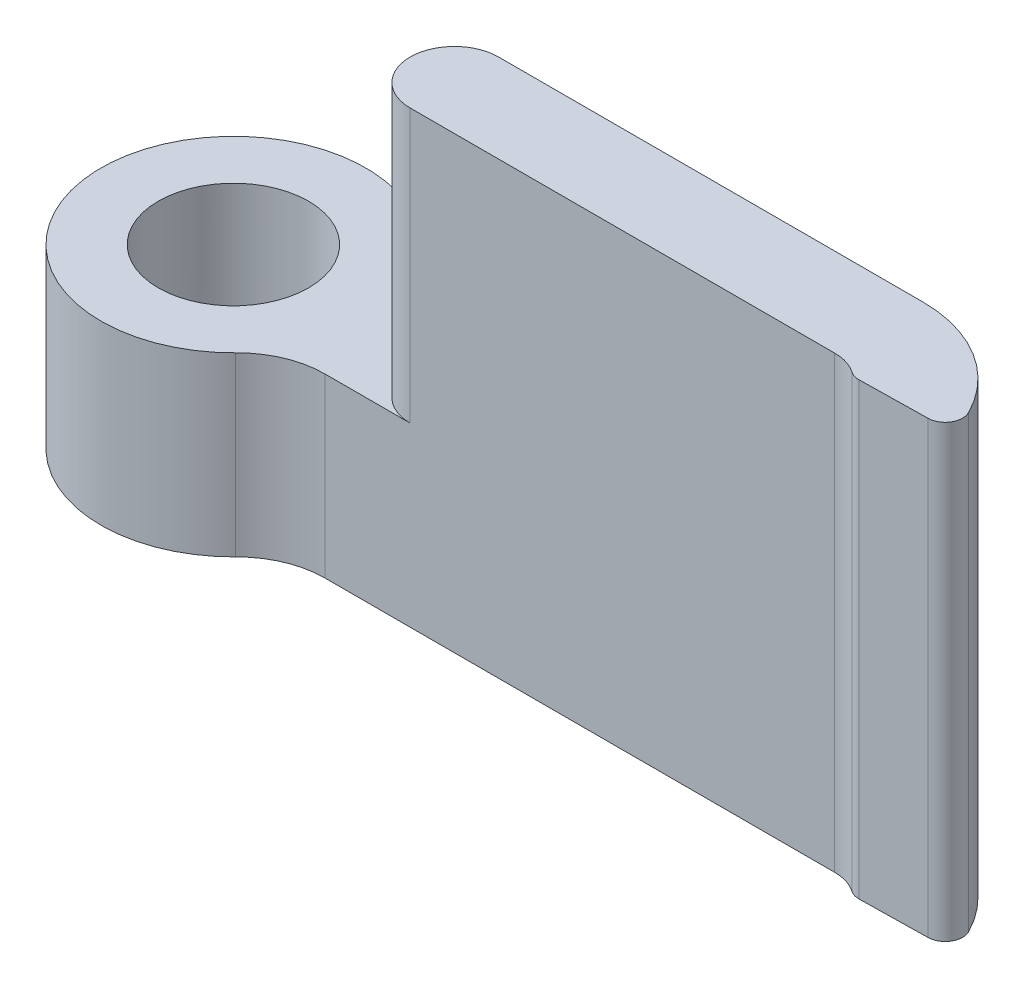
ISO-10303-21;
HEADER;
FILE_DESCRIPTION(('STEP AP214'),'2;1');
FILE_NAME('part.step','',(''),(''),'','','');
FILE_SCHEMA(('AUTOMOTIVE_DESIGN { 1 0 10303 214 1 1 1 1 }'));
ENDSEC;
DATA;
#1=APPLICATION_CONTEXT('core data for automotive mechanical design processes');
#2=APPLICATION_PROTOCOL_DEFINITION('international standard','automotive_design',2000,#1);
#3=PRODUCT_CONTEXT('',#1,'mechanical');
#4=PRODUCT('Part','Part','',(#3));
#5=PRODUCT_RELATED_PRODUCT_CATEGORY('part','',(#4));
#6=PRODUCT_DEFINITION_FORMATION('','',#4);
#7=PRODUCT_DEFINITION_CONTEXT('part definition',#1,'design');
#8=PRODUCT_DEFINITION('design','',#6,#7);
#9=PRODUCT_DEFINITION_SHAPE('','',#8);
#10=(LENGTH_UNIT() NAMED_UNIT(*) SI_UNIT(.MILLI.,.METRE.));
#11=(NAMED_UNIT(*) PLANE_ANGLE_UNIT() SI_UNIT($,.RADIAN.));
#12=(NAMED_UNIT(*) SI_UNIT($,.STERADIAN.) SOLID_ANGLE_UNIT());
#13=UNCERTAINTY_MEASURE_WITH_UNIT(LENGTH_MEASURE(1.E-05),#10,'distance_accuracy_value','');
#14=(GEOMETRIC_REPRESENTATION_CONTEXT(3) GLOBAL_UNCERTAINTY_ASSIGNED_CONTEXT((#13)) GLOBAL_UNIT_ASSIGNED_CONTEXT((#10,
#11,#12)) REPRESENTATION_CONTEXT('',''));
#15=CARTESIAN_POINT('',(0.,0.,0.));
#16=DIRECTION('',(0.,0.,1.));
#17=DIRECTION('',(1.,0.,0.));
#18=AXIS2_PLACEMENT_3D('',#15,#16,#17);
#19=CARTESIAN_POINT('',(19.1841197027665,20.63,3.175));
#20=DIRECTION('',(0.,-1.,0.));
#21=DIRECTION('',(0.,0.,-1.));
#22=AXIS2_PLACEMENT_3D('',#19,#20,#21);
#23=CYLINDRICAL_SURFACE('',#22,3.81);
#24=CARTESIAN_POINT('',(19.1841197027665,3.856199918,3.175));
#25=DIRECTION('',(0.,-1.,0.));
#26=DIRECTION('',(0.,0.,-1.));
#27=AXIS2_PLACEMENT_3D('',#24,#25,#26);
#28=CIRCLE('',#27,3.81);
#29=CARTESIAN_POINT('',(19.1841197027665,3.856199918,-0.635));
#30=VERTEX_POINT('',#29);
#31=CARTESIAN_POINT('',(22.5865531446849,3.856199918,1.46048937789378));
#32=VERTEX_POINT('',#31);
#33=EDGE_CURVE('E245',#30,#32,#28,.T.);
#34=ORIENTED_EDGE('',*,*,#33,.F.);
#35=DIRECTION('',(0.,-1.,0.));
#36=VECTOR('',#35,1.);
#37=CARTESIAN_POINT('',(19.1841197027665,20.63,-0.635));
#38=LINE('',#37,#36);
#39=CARTESIAN_POINT('',(19.1841197027665,16.7786,-0.635));
#40=VERTEX_POINT('',#39);
#41=EDGE_CURVE('E165',#40,#30,#38,.T.);
#42=ORIENTED_EDGE('',*,*,#41,.F.);
#43=CARTESIAN_POINT('',(19.1841197027665,16.7786,3.175));
#44=DIRECTION('',(0.,1.,0.));
#45=DIRECTION('',(0.,0.,1.));
#46=AXIS2_PLACEMENT_3D('',#43,#44,#45);
#47=CIRCLE('',#46,3.81);
#48=CARTESIAN_POINT('',(22.5865531446849,16.7786,1.46048937789378));
#49=VERTEX_POINT('',#48);
#50=EDGE_CURVE('E172',#49,#40,#47,.T.);
#51=ORIENTED_EDGE('',*,*,#50,.F.);
#52=DIRECTION('',(0.,-1.,0.));
#53=VECTOR('',#52,1.);
#54=CARTESIAN_POINT('',(22.5865531446849,20.63,1.46048937789378));
#55=LINE('',#54,#53);
#56=EDGE_CURVE('E168',#49,#32,#55,.T.);
#57=ORIENTED_EDGE('',*,*,#56,.T.);
#58=EDGE_LOOP('',(#34,#42,#51,#57));
#59=FACE_BOUND('',#58,.T.);
#60=ADVANCED_FACE('F35',(#59),#23,.T.);
#61=CARTESIAN_POINT('',(5.49926131403118,20.63,-0.635));
#62=DIRECTION('',(0.,0.,1.));
#63=DIRECTION('',(1.,0.,0.));
#64=AXIS2_PLACEMENT_3D('',#61,#62,#63);
#65=PLANE('',#64);
#66=DIRECTION('',(-1.,0.,0.));
#67=VECTOR('',#66,1.);
#68=CARTESIAN_POINT('',(5.49926131403118,8.936199918,-0.635));
#69=LINE('',#68,#67);
#70=CARTESIAN_POINT('',(6.985,8.936199918,-0.635));
#71=VERTEX_POINT('',#70);
#72=CARTESIAN_POINT('',(5.49926131403118,8.936199918,-0.635000000000001));
#73=VERTEX_POINT('',#72);
#74=EDGE_CURVE('E199',#71,#73,#69,.T.);
#75=ORIENTED_EDGE('',*,*,#74,.F.);
#76=DIRECTION('',(0.,1.,0.));
#77=VECTOR('',#76,1.);
#78=CARTESIAN_POINT('',(6.985,20.63,-0.635));
#79=LINE('',#78,#77);
#80=CARTESIAN_POINT('',(6.985,16.7786,-0.635));
#81=VERTEX_POINT('',#80);
#82=EDGE_CURVE('E185',#71,#81,#79,.T.);
#83=ORIENTED_EDGE('',*,*,#82,.T.);
#84=DIRECTION('',(-1.,0.,0.));
#85=VECTOR('',#84,1.);
#86=CARTESIAN_POINT('',(5.49926131403118,16.7786,-0.635));
#87=LINE('',#86,#85);
#88=EDGE_CURVE('E208',#40,#81,#87,.T.);
#89=ORIENTED_EDGE('',*,*,#88,.F.);
#90=ORIENTED_EDGE('',*,*,#41,.T.);
#91=DIRECTION('',(1.,0.,0.));
#92=VECTOR('',#91,1.);
#93=CARTESIAN_POINT('',(5.49926131403118,3.856199918,-0.635));
#94=LINE('',#93,#92);
#95=CARTESIAN_POINT('',(5.49926131403118,3.856199918,-0.635000000000001));
#96=VERTEX_POINT('',#95);
#97=EDGE_CURVE('E243',#96,#30,#94,.T.);
#98=ORIENTED_EDGE('',*,*,#97,.F.);
#99=DIRECTION('',(0.,-1.,0.));
#100=VECTOR('',#99,1.);
#101=CARTESIAN_POINT('',(5.49926131403118,20.63,-0.635));
#102=LINE('',#101,#100);
#103=EDGE_CURVE('E157',#73,#96,#102,.T.);
#104=ORIENTED_EDGE('',*,*,#103,.F.);
#105=EDGE_LOOP('',(#75,#83,#89,#90,#98,#104));
#106=FACE_BOUND('',#105,.T.);
#107=ADVANCED_FACE('F207',(#106),#65,.F.);
#108=CARTESIAN_POINT('',(19.1841197027665,20.63,1.905));
#109=DIRECTION('',(0.,0.,-1.));
#110=DIRECTION('',(-1.,0.,0.));
#111=AXIS2_PLACEMENT_3D('',#108,#109,#110);
#112=PLANE('',#111);
#113=DIRECTION('',(1.,0.,0.));
#114=VECTOR('',#113,1.);
#115=CARTESIAN_POINT('',(19.1841197027665,16.7786,1.905));
#116=LINE('',#115,#114);
#117=CARTESIAN_POINT('',(6.985,16.7786,1.905));
#118=VERTEX_POINT('',#117);
#119=CARTESIAN_POINT('',(19.1841197027665,16.7786,1.905));
#120=VERTEX_POINT('',#119);
#121=EDGE_CURVE('E219',#118,#120,#116,.T.);
#122=ORIENTED_EDGE('',*,*,#121,.F.);
#123=DIRECTION('',(0.,-1.,0.));
#124=VECTOR('',#123,1.);
#125=CARTESIAN_POINT('',(6.985,20.63,1.905));
#126=LINE('',#125,#124);
#127=CARTESIAN_POINT('',(6.985,8.936199918,1.905));
#128=VERTEX_POINT('',#127);
#129=EDGE_CURVE('E194',#118,#128,#126,.T.);
#130=ORIENTED_EDGE('',*,*,#129,.T.);
#131=DIRECTION('',(1.,0.,0.));
#132=VECTOR('',#131,1.);
#133=CARTESIAN_POINT('',(19.1841197027665,8.936199918,1.905));
#134=LINE('',#133,#132);
#135=CARTESIAN_POINT('',(4.53480705212471,8.936199918,1.905));
#136=VERTEX_POINT('',#135);
#137=EDGE_CURVE('E54',#136,#128,#134,.T.);
#138=ORIENTED_EDGE('',*,*,#137,.F.);
#139=DIRECTION('',(0.,-1.,0.));
#140=VECTOR('',#139,1.);
#141=CARTESIAN_POINT('',(4.53480705212471,20.63,1.905));
#142=LINE('',#141,#140);
#143=CARTESIAN_POINT('',(4.53480705212471,3.856199918,1.905));
#144=VERTEX_POINT('',#143);
#145=EDGE_CURVE('E155',#136,#144,#142,.T.);
#146=ORIENTED_EDGE('',*,*,#145,.T.);
#147=DIRECTION('',(-1.,0.,0.));
#148=VECTOR('',#147,1.);
#149=CARTESIAN_POINT('',(19.1841197027665,3.856199918,1.905));
#150=LINE('',#149,#148);
#151=CARTESIAN_POINT('',(19.1841197027665,3.856199918,1.905));
#152=VERTEX_POINT('',#151);
#153=EDGE_CURVE('E135',#152,#144,#150,.T.);
#154=ORIENTED_EDGE('',*,*,#153,.F.);
#155=DIRECTION('',(0.,-1.,0.));
#156=VECTOR('',#155,1.);
#157=CARTESIAN_POINT('',(19.1841197027665,20.63,1.905));
#158=LINE('',#157,#156);
#159=EDGE_CURVE('E159',#120,#152,#158,.T.);
#160=ORIENTED_EDGE('',*,*,#159,.F.);
#161=EDGE_LOOP('',(#122,#130,#138,#146,#154,#160));
#162=FACE_BOUND('',#161,.T.);
#163=ADVANCED_FACE('F241',(#162),#112,.F.);
#164=CARTESIAN_POINT('',(19.1841197027665,20.63,3.175));
#165=DIRECTION('',(0.,-1.,0.));
#166=DIRECTION('',(0.,0.,-1.));
#167=AXIS2_PLACEMENT_3D('',#164,#165,#166);
#168=CYLINDRICAL_SURFACE('',#167,1.27);
#169=CARTESIAN_POINT('',(19.1841197027665,3.856199918,3.175));
#170=DIRECTION('',(0.,-1.,0.));
#171=DIRECTION('',(0.,0.,-1.));
#172=AXIS2_PLACEMENT_3D('',#169,#170,#171);
#173=CIRCLE('',#172,1.27);
#174=CARTESIAN_POINT('',(19.9067946493673,3.856199918,2.13066244846051));
#175=VERTEX_POINT('',#174);
#176=EDGE_CURVE('E235',#175,#152,#173,.F.);
#177=ORIENTED_EDGE('',*,*,#176,.F.);
#178=DIRECTION('',(0.,-1.,0.));
#179=VECTOR('',#178,1.);
#180=CARTESIAN_POINT('',(19.9067946493673,20.63,2.13066244846051));
#181=LINE('',#180,#179);
#182=CARTESIAN_POINT('',(19.9067946493673,16.7786,2.13066244846051));
#183=VERTEX_POINT('',#182);
#184=EDGE_CURVE('E180',#175,#183,#181,.F.);
#185=ORIENTED_EDGE('',*,*,#184,.T.);
#186=CARTESIAN_POINT('',(19.1841197027665,16.7786,3.175));
#187=DIRECTION('',(0.,1.,0.));
#188=DIRECTION('',(0.,0.,1.));
#189=AXIS2_PLACEMENT_3D('',#186,#187,#188);
#190=CIRCLE('',#189,1.27);
#191=EDGE_CURVE('E238',#120,#183,#190,.F.);
#192=ORIENTED_EDGE('',*,*,#191,.F.);
#193=ORIENTED_EDGE('',*,*,#159,.T.);
#194=EDGE_LOOP('',(#177,#185,#192,#193));
#195=FACE_BOUND('',#194,.T.);
#196=ADVANCED_FACE('F234',(#195),#168,.F.);
#197=CARTESIAN_POINT('',(22.86,20.63,2.17299997983507));
#198=DIRECTION('',(-0.0174524064372835,0.,-0.999847695156391));
#199=DIRECTION('',(-0.999847695156391,0.,0.0174524064372835));
#200=AXIS2_PLACEMENT_3D('',#197,#198,#199);
#201=PLANE('',#200);
#202=DIRECTION('',(-0.999847695156391,0.,0.0174524064372835));
#203=VECTOR('',#202,1.);
#204=CARTESIAN_POINT('',(22.86,3.856199918,2.17299997983507));
#205=LINE('',#204,#203);
#206=CARTESIAN_POINT('',(22.1487657728487,3.856199918,2.18541461944917));
#207=VERTEX_POINT('',#206);
#208=CARTESIAN_POINT('',(20.2000385480981,3.856199918,2.21942977968457));
#209=VERTEX_POINT('',#208);
#210=EDGE_CURVE('E253',#207,#209,#205,.T.);
#211=ORIENTED_EDGE('',*,*,#210,.F.);
#212=DIRECTION('',(0.,-1.,0.));
#213=VECTOR('',#212,1.);
#214=CARTESIAN_POINT('',(22.1487657728487,20.63,2.18541461944917));
#215=LINE('',#214,#213);
#216=CARTESIAN_POINT('',(22.1487657728487,16.7786,2.18541461944917));
#217=VERTEX_POINT('',#216);
#218=EDGE_CURVE('E178',#207,#217,#215,.F.);
#219=ORIENTED_EDGE('',*,*,#218,.T.);
#220=DIRECTION('',(0.999847695156391,0.,-0.0174524064372835));
#221=VECTOR('',#220,1.);
#222=CARTESIAN_POINT('',(22.86,16.7786,2.17299997983507));
#223=LINE('',#222,#221);
#224=CARTESIAN_POINT('',(20.2000385480981,16.7786,2.21942977968457));
#225=VERTEX_POINT('',#224);
#226=EDGE_CURVE('E259',#225,#217,#223,.T.);
#227=ORIENTED_EDGE('',*,*,#226,.F.);
#228=DIRECTION('',(0.,-1.,0.));
#229=VECTOR('',#228,1.);
#230=CARTESIAN_POINT('',(20.2000385480981,20.63,2.21942977968457));
#231=LINE('',#230,#229);
#232=EDGE_CURVE('E175',#225,#209,#231,.T.);
#233=ORIENTED_EDGE('',*,*,#232,.T.);
#234=EDGE_LOOP('',(#211,#219,#227,#233));
#235=FACE_BOUND('',#234,.T.);
#236=ADVANCED_FACE('F283',(#235),#201,.F.);
#237=CARTESIAN_POINT('',(22.14003956963,20.63,1.68549077187097));
#238=DIRECTION('',(0.,-1.,0.));
#239=DIRECTION('',(0.,0.,-1.));
#240=AXIS2_PLACEMENT_3D('',#237,#238,#239);
#241=CYLINDRICAL_SURFACE('',#240,0.5);
#242=ORIENTED_EDGE('',*,*,#218,.F.);
#243=CARTESIAN_POINT('',(22.14003956963,3.856199918,1.68549077187097));
#244=DIRECTION('',(0.,-1.,0.));
#245=DIRECTION('',(0.,0.,-1.));
#246=AXIS2_PLACEMENT_3D('',#243,#244,#245);
#247=CIRCLE('',#246,0.5);
#248=EDGE_CURVE('E250',#207,#32,#247,.F.);
#249=ORIENTED_EDGE('',*,*,#248,.T.);
#250=ORIENTED_EDGE('',*,*,#56,.F.);
#251=CARTESIAN_POINT('',(22.14003956963,16.7786,1.68549077187097));
#252=DIRECTION('',(0.,1.,0.));
#253=DIRECTION('',(0.,0.,1.));
#254=AXIS2_PLACEMENT_3D('',#251,#252,#253);
#255=CIRCLE('',#254,0.5);
#256=EDGE_CURVE('E215',#49,#217,#255,.F.);
#257=ORIENTED_EDGE('',*,*,#256,.T.);
#258=EDGE_LOOP('',(#242,#249,#250,#257));
#259=FACE_BOUND('',#258,.T.);
#260=ADVANCED_FACE('F279',(#259),#241,.T.);
#261=CARTESIAN_POINT('',(20.1913123448794,20.63,1.71950593210638));
#262=DIRECTION('',(0.,-1.,0.));
#263=DIRECTION('',(0.,0.,-1.));
#264=AXIS2_PLACEMENT_3D('',#261,#262,#263);
#265=CYLINDRICAL_SURFACE('',#264,0.5);
#266=ORIENTED_EDGE('',*,*,#184,.F.);
#267=CARTESIAN_POINT('',(20.1913123448794,3.856199918,1.71950593210638));
#268=DIRECTION('',(0.,-1.,0.));
#269=DIRECTION('',(0.,0.,-1.));
#270=AXIS2_PLACEMENT_3D('',#267,#268,#269);
#271=CIRCLE('',#270,0.5);
#272=EDGE_CURVE('E256',#175,#209,#271,.F.);
#273=ORIENTED_EDGE('',*,*,#272,.T.);
#274=ORIENTED_EDGE('',*,*,#232,.F.);
#275=CARTESIAN_POINT('',(20.1913123448794,16.7786,1.71950593210638));
#276=DIRECTION('',(0.,1.,0.));
#277=DIRECTION('',(0.,0.,1.));
#278=AXIS2_PLACEMENT_3D('',#275,#276,#277);
#279=CIRCLE('',#278,0.5);
#280=EDGE_CURVE('E182',#225,#183,#279,.F.);
#281=ORIENTED_EDGE('',*,*,#280,.T.);
#282=EDGE_LOOP('',(#266,#273,#274,#281));
#283=FACE_BOUND('',#282,.T.);
#284=ADVANCED_FACE('F282',(#283),#265,.T.);
#285=CARTESIAN_POINT('',(5.49926131403118,20.63,-3.175));
#286=DIRECTION('',(0.,-1.,0.));
#287=DIRECTION('',(0.,0.,-1.));
#288=AXIS2_PLACEMENT_3D('',#285,#286,#287);
#289=CYLINDRICAL_SURFACE('',#288,2.54);
#290=CARTESIAN_POINT('',(5.49926131403118,3.856199918,-3.175));
#291=DIRECTION('',(0.,-1.,0.));
#292=DIRECTION('',(0.,0.,-1.));
#293=AXIS2_PLACEMENT_3D('',#290,#291,#292);
#294=CIRCLE('',#293,2.54);
#295=CARTESIAN_POINT('',(3.29955678841871,3.856199918,-1.905));
#296=VERTEX_POINT('',#295);
#297=EDGE_CURVE('E150',#296,#96,#294,.F.);
#298=ORIENTED_EDGE('',*,*,#297,.F.);
#299=DIRECTION('',(0.,-1.,0.));
#300=VECTOR('',#299,1.);
#301=CARTESIAN_POINT('',(3.29955678841871,20.63,-1.905));
#302=LINE('',#301,#300);
#303=CARTESIAN_POINT('',(3.29955678841871,8.936199918,-1.905));
#304=VERTEX_POINT('',#303);
#305=EDGE_CURVE('E149',#304,#296,#302,.T.);
#306=ORIENTED_EDGE('',*,*,#305,.F.);
#307=CARTESIAN_POINT('',(5.49926131403118,8.936199918,-3.175));
#308=DIRECTION('',(0.,1.,0.));
#309=DIRECTION('',(0.,0.,1.));
#310=AXIS2_PLACEMENT_3D('',#307,#308,#309);
#311=CIRCLE('',#310,2.54);
#312=EDGE_CURVE('E227',#73,#304,#311,.F.);
#313=ORIENTED_EDGE('',*,*,#312,.F.);
#314=ORIENTED_EDGE('',*,*,#103,.T.);
#315=EDGE_LOOP('',(#298,#306,#313,#314));
#316=FACE_BOUND('',#315,.T.);
#317=ADVANCED_FACE('F286',(#316),#289,.F.);
#318=CARTESIAN_POINT('',(0.,20.63,0.));
#319=DIRECTION('',(0.,-1.,0.));
#320=DIRECTION('',(0.,0.,-1.));
#321=AXIS2_PLACEMENT_3D('',#318,#319,#320);
#322=CYLINDRICAL_SURFACE('',#321,3.80999999999999);
#323=CARTESIAN_POINT('',(0.,3.856199918,0.));
#324=DIRECTION('',(0.,-1.,0.));
#325=DIRECTION('',(0.,0.,-1.));
#326=AXIS2_PLACEMENT_3D('',#323,#324,#325);
#327=CIRCLE('',#326,3.80999999999999);
#328=CARTESIAN_POINT('',(2.72088423127483,3.856199918,2.667));
#329=VERTEX_POINT('',#328);
#330=EDGE_CURVE('E132',#329,#296,#327,.T.);
#331=ORIENTED_EDGE('',*,*,#330,.F.);
#332=DIRECTION('',(0.,-1.,0.));
#333=VECTOR('',#332,1.);
#334=CARTESIAN_POINT('',(2.72088423127483,20.63,2.667));
#335=LINE('',#334,#333);
#336=CARTESIAN_POINT('',(2.72088423127483,8.936199918,2.667));
#337=VERTEX_POINT('',#336);
#338=EDGE_CURVE('E147',#337,#329,#335,.T.);
#339=ORIENTED_EDGE('',*,*,#338,.F.);
#340=CARTESIAN_POINT('',(0.,8.936199918,0.));
#341=DIRECTION('',(0.,1.,0.));
#342=DIRECTION('',(0.,0.,1.));
#343=AXIS2_PLACEMENT_3D('',#340,#341,#342);
#344=CIRCLE('',#343,3.80999999999999);
#345=EDGE_CURVE('E225',#304,#337,#344,.T.);
#346=ORIENTED_EDGE('',*,*,#345,.F.);
#347=ORIENTED_EDGE('',*,*,#305,.T.);
#348=EDGE_LOOP('',(#331,#339,#346,#347));
#349=FACE_BOUND('',#348,.T.);
#350=ADVANCED_FACE('F145',(#349),#322,.T.);
#351=CARTESIAN_POINT('',(4.53480705212471,20.63,4.445));
#352=DIRECTION('',(0.,-1.,0.));
#353=DIRECTION('',(0.,0.,-1.));
#354=AXIS2_PLACEMENT_3D('',#351,#352,#353);
#355=CYLINDRICAL_SURFACE('',#354,2.54);
#356=CARTESIAN_POINT('',(4.53480705212471,3.856199918,4.445));
#357=DIRECTION('',(0.,-1.,0.));
#358=DIRECTION('',(0.,0.,-1.));
#359=AXIS2_PLACEMENT_3D('',#356,#357,#358);
#360=CIRCLE('',#359,2.54);
#361=EDGE_CURVE('E128',#144,#329,#360,.F.);
#362=ORIENTED_EDGE('',*,*,#361,.F.);
#363=ORIENTED_EDGE('',*,*,#145,.F.);
#364=CARTESIAN_POINT('',(4.53480705212471,8.936199918,4.445));
#365=DIRECTION('',(0.,1.,0.));
#366=DIRECTION('',(0.,0.,1.));
#367=AXIS2_PLACEMENT_3D('',#364,#365,#366);
#368=CIRCLE('',#367,2.54);
#369=EDGE_CURVE('E154',#337,#136,#368,.F.);
#370=ORIENTED_EDGE('',*,*,#369,.F.);
#371=ORIENTED_EDGE('',*,*,#338,.T.);
#372=EDGE_LOOP('',(#362,#363,#370,#371));
#373=FACE_BOUND('',#372,.T.);
#374=ADVANCED_FACE('F153',(#373),#355,.F.);
#375=CARTESIAN_POINT('',(0.,20.63,0.));
#376=DIRECTION('',(0.,-1.,0.));
#377=DIRECTION('',(0.,0.,-1.));
#378=AXIS2_PLACEMENT_3D('',#375,#376,#377);
#379=CYLINDRICAL_SURFACE('',#378,2.159);
#380=CARTESIAN_POINT('',(0.,8.936199918,0.));
#381=DIRECTION('',(0.,1.,0.));
#382=DIRECTION('',(0.,0.,1.));
#383=AXIS2_PLACEMENT_3D('',#380,#381,#382);
#384=CIRCLE('',#383,2.159);
#385=CARTESIAN_POINT('',(0.,8.936199918,2.15900000000001));
#386=VERTEX_POINT('',#385);
#387=EDGE_CURVE('E169',#386,#386,#384,.T.);
#388=ORIENTED_EDGE('',*,*,#387,.T.);
#389=EDGE_LOOP('',(#388));
#390=FACE_BOUND('',#389,.T.);
#391=CARTESIAN_POINT('',(0.,3.856199918,0.));
#392=DIRECTION('',(0.,-1.,0.));
#393=DIRECTION('',(0.,0.,-1.));
#394=AXIS2_PLACEMENT_3D('',#391,#392,#393);
#395=CIRCLE('',#394,2.159);
#396=CARTESIAN_POINT('',(0.,3.856199918,-2.15899999999999));
#397=VERTEX_POINT('',#396);
#398=EDGE_CURVE('E140',#397,#397,#395,.T.);
#399=ORIENTED_EDGE('',*,*,#398,.T.);
#400=EDGE_LOOP('',(#399));
#401=FACE_BOUND('',#400,.T.);
#402=ADVANCED_FACE('F306',(#390,#401),#379,.F.);
#403=CARTESIAN_POINT('',(0.,8.936199918,0.));
#404=DIRECTION('',(0.,1.,0.));
#405=DIRECTION('',(0.,0.,1.));
#406=AXIS2_PLACEMENT_3D('',#403,#404,#405);
#407=PLANE('',#406);
#408=ORIENTED_EDGE('',*,*,#387,.F.);
#409=EDGE_LOOP('',(#408));
#410=FACE_BOUND('',#409,.T.);
#411=ORIENTED_EDGE('',*,*,#74,.T.);
#412=ORIENTED_EDGE('',*,*,#312,.T.);
#413=ORIENTED_EDGE('',*,*,#345,.T.);
#414=ORIENTED_EDGE('',*,*,#369,.T.);
#415=ORIENTED_EDGE('',*,*,#137,.T.);
#416=CARTESIAN_POINT('',(6.985,8.936199918,0.635));
#417=DIRECTION('',(0.,1.,0.));
#418=DIRECTION('',(0.,0.,1.));
#419=AXIS2_PLACEMENT_3D('',#416,#417,#418);
#420=CIRCLE('',#419,1.27);
#421=CARTESIAN_POINT('',(5.715,8.936199918,0.635));
#422=VERTEX_POINT('',#421);
#423=EDGE_CURVE('E12',#128,#422,#420,.F.);
#424=ORIENTED_EDGE('',*,*,#423,.T.);
#425=CARTESIAN_POINT('',(6.985,8.936199918,0.635));
#426=DIRECTION('',(0.,1.,0.));
#427=DIRECTION('',(0.,0.,1.));
#428=AXIS2_PLACEMENT_3D('',#425,#426,#427);
#429=CIRCLE('',#428,1.27);
#430=EDGE_CURVE('E44',#422,#71,#429,.F.);
#431=ORIENTED_EDGE('',*,*,#430,.T.);
#432=EDGE_LOOP('',(#411,#412,#413,#414,#415,#424,#431));
#433=FACE_BOUND('',#432,.T.);
#434=ADVANCED_FACE('F198',(#410,#433),#407,.T.);
#435=CARTESIAN_POINT('',(0.,16.7786,0.));
#436=DIRECTION('',(0.,1.,0.));
#437=DIRECTION('',(0.,0.,1.));
#438=AXIS2_PLACEMENT_3D('',#435,#436,#437);
#439=PLANE('',#438);
#440=ORIENTED_EDGE('',*,*,#88,.T.);
#441=CARTESIAN_POINT('',(6.985,16.7786,0.635));
#442=DIRECTION('',(0.,1.,0.));
#443=DIRECTION('',(0.,0.,1.));
#444=AXIS2_PLACEMENT_3D('',#441,#442,#443);
#445=CIRCLE('',#444,1.27);
#446=CARTESIAN_POINT('',(5.715,16.7786,0.635));
#447=VERTEX_POINT('',#446);
#448=EDGE_CURVE('E192',#81,#447,#445,.T.);
#449=ORIENTED_EDGE('',*,*,#448,.T.);
#450=CARTESIAN_POINT('',(6.985,16.7786,0.635));
#451=DIRECTION('',(0.,1.,0.));
#452=DIRECTION('',(0.,0.,1.));
#453=AXIS2_PLACEMENT_3D('',#450,#451,#452);
#454=CIRCLE('',#453,1.27);
#455=EDGE_CURVE('E190',#447,#118,#454,.T.);
#456=ORIENTED_EDGE('',*,*,#455,.T.);
#457=ORIENTED_EDGE('',*,*,#121,.T.);
#458=ORIENTED_EDGE('',*,*,#191,.T.);
#459=ORIENTED_EDGE('',*,*,#280,.F.);
#460=ORIENTED_EDGE('',*,*,#226,.T.);
#461=ORIENTED_EDGE('',*,*,#256,.F.);
#462=ORIENTED_EDGE('',*,*,#50,.T.);
#463=EDGE_LOOP('',(#440,#449,#456,#457,#458,#459,#460,#461,#462));
#464=FACE_BOUND('',#463,.T.);
#465=ADVANCED_FACE('F212',(#464),#439,.T.);
#466=CARTESIAN_POINT('',(0.,3.856199918,0.));
#467=DIRECTION('',(0.,-1.,0.));
#468=DIRECTION('',(0.,0.,-1.));
#469=AXIS2_PLACEMENT_3D('',#466,#467,#468);
#470=PLANE('',#469);
#471=ORIENTED_EDGE('',*,*,#176,.T.);
#472=ORIENTED_EDGE('',*,*,#153,.T.);
#473=ORIENTED_EDGE('',*,*,#361,.T.);
#474=ORIENTED_EDGE('',*,*,#330,.T.);
#475=ORIENTED_EDGE('',*,*,#297,.T.);
#476=ORIENTED_EDGE('',*,*,#97,.T.);
#477=ORIENTED_EDGE('',*,*,#33,.T.);
#478=ORIENTED_EDGE('',*,*,#248,.F.);
#479=ORIENTED_EDGE('',*,*,#210,.T.);
#480=ORIENTED_EDGE('',*,*,#272,.F.);
#481=EDGE_LOOP('',(#471,#472,#473,#474,#475,#476,#477,#478,#479,#480));
#482=FACE_BOUND('',#481,.T.);
#483=ORIENTED_EDGE('',*,*,#398,.F.);
#484=EDGE_LOOP('',(#483));
#485=FACE_BOUND('',#484,.T.);
#486=ADVANCED_FACE('F130',(#482,#485),#470,.T.);
#487=CARTESIAN_POINT('',(6.985,20.63,0.635));
#488=DIRECTION('',(0.,-1.,0.));
#489=DIRECTION('',(0.,0.,-1.));
#490=AXIS2_PLACEMENT_3D('',#487,#488,#489);
#491=CYLINDRICAL_SURFACE('',#490,1.27);
#492=DIRECTION('',(0.,-1.,0.));
#493=VECTOR('',#492,1.);
#494=CARTESIAN_POINT('',(5.715,8.936199918,0.635));
#495=LINE('',#494,#493);
#496=EDGE_CURVE('E39',#422,#447,#495,.F.);
#497=ORIENTED_EDGE('',*,*,#496,.F.);
#498=ORIENTED_EDGE('',*,*,#423,.F.);
#499=ORIENTED_EDGE('',*,*,#129,.F.);
#500=ORIENTED_EDGE('',*,*,#455,.F.);
#501=EDGE_LOOP('',(#497,#498,#499,#500));
#502=FACE_BOUND('',#501,.T.);
#503=ADVANCED_FACE('F37',(#502),#491,.T.);
#504=CARTESIAN_POINT('',(6.985,20.63,0.635));
#505=DIRECTION('',(0.,1.,0.));
#506=DIRECTION('',(0.,0.,1.));
#507=AXIS2_PLACEMENT_3D('',#504,#505,#506);
#508=CYLINDRICAL_SURFACE('',#507,1.27);
#509=ORIENTED_EDGE('',*,*,#430,.F.);
#510=ORIENTED_EDGE('',*,*,#496,.T.);
#511=ORIENTED_EDGE('',*,*,#448,.F.);
#512=ORIENTED_EDGE('',*,*,#82,.F.);
#513=EDGE_LOOP('',(#509,#510,#511,#512));
#514=FACE_BOUND('',#513,.T.);
#515=ADVANCED_FACE('F203',(#514),#508,.T.);
#516=CLOSED_SHELL('',(#60,#107,#163,#196,#236,#260,#284,#317,#350,#374,#402,#434,#465,#486,#503,#515));
#517=MANIFOLD_SOLID_BREP('B2',#516);
#518=ADVANCED_BREP_SHAPE_REPRESENTATION('',(#18,#517),#14);
#519=SHAPE_DEFINITION_REPRESENTATION(#9,#518);
ENDSEC;
END-ISO-10303-21;
